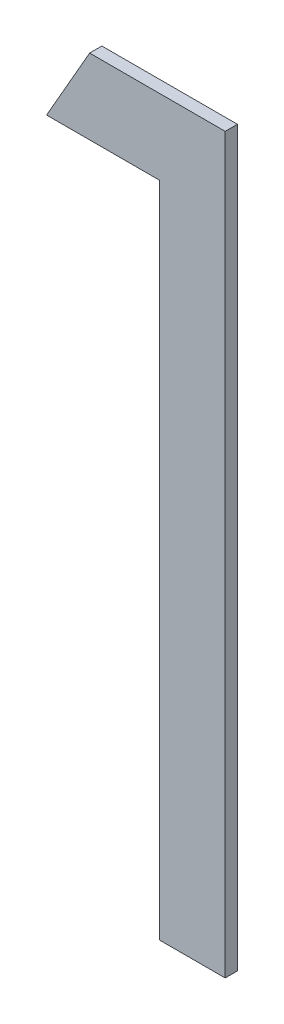
ISO-10303-21;
HEADER;
FILE_DESCRIPTION(('STEP AP214'),'2;1');
FILE_NAME('part.step','',(''),(''),'','','');
FILE_SCHEMA(('AUTOMOTIVE_DESIGN { 1 0 10303 214 1 1 1 1 }'));
ENDSEC;
DATA;
#1=APPLICATION_CONTEXT('core data for automotive mechanical design processes');
#2=APPLICATION_PROTOCOL_DEFINITION('international standard','automotive_design',2000,#1);
#3=PRODUCT_CONTEXT('',#1,'mechanical');
#4=PRODUCT('Part','Part','',(#3));
#5=PRODUCT_RELATED_PRODUCT_CATEGORY('part','',(#4));
#6=PRODUCT_DEFINITION_FORMATION('','',#4);
#7=PRODUCT_DEFINITION_CONTEXT('part definition',#1,'design');
#8=PRODUCT_DEFINITION('design','',#6,#7);
#9=PRODUCT_DEFINITION_SHAPE('','',#8);
#10=(LENGTH_UNIT() NAMED_UNIT(*) SI_UNIT(.MILLI.,.METRE.));
#11=(NAMED_UNIT(*) PLANE_ANGLE_UNIT() SI_UNIT($,.RADIAN.));
#12=(NAMED_UNIT(*) SI_UNIT($,.STERADIAN.) SOLID_ANGLE_UNIT());
#13=UNCERTAINTY_MEASURE_WITH_UNIT(LENGTH_MEASURE(1.E-05),#10,'distance_accuracy_value','');
#14=(GEOMETRIC_REPRESENTATION_CONTEXT(3) GLOBAL_UNCERTAINTY_ASSIGNED_CONTEXT((#13)) GLOBAL_UNIT_ASSIGNED_CONTEXT((#10,
#11,#12)) REPRESENTATION_CONTEXT('',''));
#15=CARTESIAN_POINT('',(0.,0.,0.));
#16=DIRECTION('',(0.,0.,1.));
#17=DIRECTION('',(1.,0.,0.));
#18=AXIS2_PLACEMENT_3D('',#15,#16,#17);
#19=CARTESIAN_POINT('',(0.426153846153846,0.912730110006543,0.551));
#20=DIRECTION('',(-0.867930013859703,0.496686511837693,0.));
#21=DIRECTION('',(-0.496686511837693,-0.867930013859703,0.));
#22=AXIS2_PLACEMENT_3D('',#19,#20,#21);
#23=PLANE('',#22);
#24=DIRECTION('',(0.496686511837692,0.867930013859704,0.));
#25=VECTOR('',#24,1.);
#26=CARTESIAN_POINT('',(0.426153846153846,0.912730110006543,0.55));
#27=LINE('',#26,#25);
#28=CARTESIAN_POINT('',(0.426153846153846,0.912730110006543,0.55));
#29=VERTEX_POINT('',#28);
#30=CARTESIAN_POINT('',(0.429675480769231,0.918883956160389,0.55));
#31=VERTEX_POINT('',#30);
#32=EDGE_CURVE('E11',#29,#31,#27,.T.);
#33=ORIENTED_EDGE('',*,*,#32,.F.);
#34=DIRECTION('',(0.,0.,-1.));
#35=VECTOR('',#34,1.);
#36=CARTESIAN_POINT('',(0.426153846153846,0.912730110006543,0.551));
#37=LINE('',#36,#35);
#38=CARTESIAN_POINT('',(0.426153846153846,0.912730110006543,0.551));
#39=VERTEX_POINT('',#38);
#40=EDGE_CURVE('E119',#39,#29,#37,.T.);
#41=ORIENTED_EDGE('',*,*,#40,.F.);
#42=DIRECTION('',(0.496686511837692,0.867930013859704,0.));
#43=VECTOR('',#42,1.);
#44=CARTESIAN_POINT('',(0.426153846153846,0.912730110006543,0.551));
#45=LINE('',#44,#43);
#46=CARTESIAN_POINT('',(0.429675480769231,0.918883956160389,0.551));
#47=VERTEX_POINT('',#46);
#48=EDGE_CURVE('E112',#39,#47,#45,.T.);
#49=ORIENTED_EDGE('',*,*,#48,.T.);
#50=DIRECTION('',(0.,0.,-1.));
#51=VECTOR('',#50,1.);
#52=CARTESIAN_POINT('',(0.429675480769231,0.918883956160389,0.551));
#53=LINE('',#52,#51);
#54=EDGE_CURVE('E85',#47,#31,#53,.T.);
#55=ORIENTED_EDGE('',*,*,#54,.T.);
#56=EDGE_LOOP('',(#33,#41,#49,#55));
#57=FACE_BOUND('',#56,.T.);
#58=ADVANCED_FACE('F17',(#57),#23,.T.);
#59=CARTESIAN_POINT('',(0.435384615384616,0.912730110006543,0.551));
#60=DIRECTION('',(0.,-1.,0.));
#61=DIRECTION('',(0.,0.,-1.));
#62=AXIS2_PLACEMENT_3D('',#59,#60,#61);
#63=PLANE('',#62);
#64=DIRECTION('',(-1.,0.,0.));
#65=VECTOR('',#64,1.);
#66=CARTESIAN_POINT('',(0.435384615384616,0.912730110006543,0.55));
#67=LINE('',#66,#65);
#68=CARTESIAN_POINT('',(0.435384615384616,0.912730110006543,0.55));
#69=VERTEX_POINT('',#68);
#70=EDGE_CURVE('E24',#69,#29,#67,.T.);
#71=ORIENTED_EDGE('',*,*,#70,.F.);
#72=DIRECTION('',(0.,0.,-1.));
#73=VECTOR('',#72,1.);
#74=CARTESIAN_POINT('',(0.435384615384616,0.912730110006543,0.551));
#75=LINE('',#74,#73);
#76=CARTESIAN_POINT('',(0.435384615384616,0.912730110006543,0.551));
#77=VERTEX_POINT('',#76);
#78=EDGE_CURVE('E114',#77,#69,#75,.T.);
#79=ORIENTED_EDGE('',*,*,#78,.F.);
#80=DIRECTION('',(-1.,0.,0.));
#81=VECTOR('',#80,1.);
#82=CARTESIAN_POINT('',(0.435384615384616,0.912730110006543,0.551));
#83=LINE('',#82,#81);
#84=EDGE_CURVE('E103',#77,#39,#83,.T.);
#85=ORIENTED_EDGE('',*,*,#84,.T.);
#86=ORIENTED_EDGE('',*,*,#40,.T.);
#87=EDGE_LOOP('',(#71,#79,#85,#86));
#88=FACE_BOUND('',#87,.T.);
#89=ADVANCED_FACE('F127',(#88),#63,.T.);
#90=CARTESIAN_POINT('',(0.435384615384616,0.858883956160389,0.551));
#91=DIRECTION('',(-1.,0.,0.));
#92=DIRECTION('',(0.,0.,1.));
#93=AXIS2_PLACEMENT_3D('',#90,#91,#92);
#94=PLANE('',#93);
#95=DIRECTION('',(0.,1.,0.));
#96=VECTOR('',#95,1.);
#97=CARTESIAN_POINT('',(0.435384615384616,0.858883956160389,0.55));
#98=LINE('',#97,#96);
#99=CARTESIAN_POINT('',(0.435384615384616,0.858883956160389,0.55));
#100=VERTEX_POINT('',#99);
#101=EDGE_CURVE('E116',#100,#69,#98,.T.);
#102=ORIENTED_EDGE('',*,*,#101,.F.);
#103=DIRECTION('',(0.,0.,-1.));
#104=VECTOR('',#103,1.);
#105=CARTESIAN_POINT('',(0.435384615384616,0.858883956160389,0.551));
#106=LINE('',#105,#104);
#107=CARTESIAN_POINT('',(0.435384615384616,0.858883956160389,0.551));
#108=VERTEX_POINT('',#107);
#109=EDGE_CURVE('E106',#108,#100,#106,.T.);
#110=ORIENTED_EDGE('',*,*,#109,.F.);
#111=DIRECTION('',(0.,1.,0.));
#112=VECTOR('',#111,1.);
#113=CARTESIAN_POINT('',(0.435384615384616,0.858883956160389,0.551));
#114=LINE('',#113,#112);
#115=EDGE_CURVE('E96',#108,#77,#114,.T.);
#116=ORIENTED_EDGE('',*,*,#115,.T.);
#117=ORIENTED_EDGE('',*,*,#78,.T.);
#118=EDGE_LOOP('',(#102,#110,#116,#117));
#119=FACE_BOUND('',#118,.T.);
#120=ADVANCED_FACE('F123',(#119),#94,.T.);
#121=CARTESIAN_POINT('',(0.440769230769231,0.858883956160389,0.551));
#122=DIRECTION('',(0.,-1.,0.));
#123=DIRECTION('',(0.,0.,-1.));
#124=AXIS2_PLACEMENT_3D('',#121,#122,#123);
#125=PLANE('',#124);
#126=DIRECTION('',(-1.,0.,0.));
#127=VECTOR('',#126,1.);
#128=CARTESIAN_POINT('',(0.440769230769231,0.858883956160389,0.55));
#129=LINE('',#128,#127);
#130=CARTESIAN_POINT('',(0.440769230769231,0.858883956160389,0.55));
#131=VERTEX_POINT('',#130);
#132=EDGE_CURVE('E109',#131,#100,#129,.T.);
#133=ORIENTED_EDGE('',*,*,#132,.F.);
#134=DIRECTION('',(0.,0.,-1.));
#135=VECTOR('',#134,1.);
#136=CARTESIAN_POINT('',(0.440769230769231,0.858883956160389,0.551));
#137=LINE('',#136,#135);
#138=CARTESIAN_POINT('',(0.440769230769231,0.858883956160389,0.551));
#139=VERTEX_POINT('',#138);
#140=EDGE_CURVE('E99',#139,#131,#137,.T.);
#141=ORIENTED_EDGE('',*,*,#140,.F.);
#142=DIRECTION('',(-1.,0.,0.));
#143=VECTOR('',#142,1.);
#144=CARTESIAN_POINT('',(0.440769230769231,0.858883956160389,0.551));
#145=LINE('',#144,#143);
#146=EDGE_CURVE('E79',#139,#108,#145,.T.);
#147=ORIENTED_EDGE('',*,*,#146,.T.);
#148=ORIENTED_EDGE('',*,*,#109,.T.);
#149=EDGE_LOOP('',(#133,#141,#147,#148));
#150=FACE_BOUND('',#149,.T.);
#151=ADVANCED_FACE('F125',(#150),#125,.T.);
#152=CARTESIAN_POINT('',(0.440769230769231,0.918883956160389,0.551));
#153=DIRECTION('',(1.,0.,0.));
#154=DIRECTION('',(0.,0.,-1.));
#155=AXIS2_PLACEMENT_3D('',#152,#153,#154);
#156=PLANE('',#155);
#157=DIRECTION('',(0.,-1.,0.));
#158=VECTOR('',#157,1.);
#159=CARTESIAN_POINT('',(0.440769230769231,0.918883956160389,0.55));
#160=LINE('',#159,#158);
#161=CARTESIAN_POINT('',(0.440769230769231,0.918883956160389,0.55));
#162=VERTEX_POINT('',#161);
#163=EDGE_CURVE('E74',#162,#131,#160,.T.);
#164=ORIENTED_EDGE('',*,*,#163,.F.);
#165=DIRECTION('',(0.,0.,-1.));
#166=VECTOR('',#165,1.);
#167=CARTESIAN_POINT('',(0.440769230769231,0.918883956160389,0.551));
#168=LINE('',#167,#166);
#169=CARTESIAN_POINT('',(0.440769230769231,0.918883956160389,0.551));
#170=VERTEX_POINT('',#169);
#171=EDGE_CURVE('E66',#170,#162,#168,.T.);
#172=ORIENTED_EDGE('',*,*,#171,.F.);
#173=DIRECTION('',(0.,-1.,0.));
#174=VECTOR('',#173,1.);
#175=CARTESIAN_POINT('',(0.440769230769231,0.918883956160389,0.551));
#176=LINE('',#175,#174);
#177=EDGE_CURVE('E71',#170,#139,#176,.T.);
#178=ORIENTED_EDGE('',*,*,#177,.T.);
#179=ORIENTED_EDGE('',*,*,#140,.T.);
#180=EDGE_LOOP('',(#164,#172,#178,#179));
#181=FACE_BOUND('',#180,.T.);
#182=ADVANCED_FACE('F68',(#181),#156,.T.);
#183=CARTESIAN_POINT('',(0.429675480769231,0.918883956160389,0.551));
#184=DIRECTION('',(0.,1.,0.));
#185=DIRECTION('',(0.,0.,1.));
#186=AXIS2_PLACEMENT_3D('',#183,#184,#185);
#187=PLANE('',#186);
#188=DIRECTION('',(1.,0.,0.));
#189=VECTOR('',#188,1.);
#190=CARTESIAN_POINT('',(0.429675480769231,0.918883956160389,0.55));
#191=LINE('',#190,#189);
#192=EDGE_CURVE('E78',#31,#162,#191,.T.);
#193=ORIENTED_EDGE('',*,*,#192,.F.);
#194=ORIENTED_EDGE('',*,*,#54,.F.);
#195=DIRECTION('',(1.,0.,0.));
#196=VECTOR('',#195,1.);
#197=CARTESIAN_POINT('',(0.429675480769231,0.918883956160389,0.551));
#198=LINE('',#197,#196);
#199=EDGE_CURVE('E83',#47,#170,#198,.T.);
#200=ORIENTED_EDGE('',*,*,#199,.T.);
#201=ORIENTED_EDGE('',*,*,#171,.T.);
#202=EDGE_LOOP('',(#193,#194,#200,#201));
#203=FACE_BOUND('',#202,.T.);
#204=ADVANCED_FACE('F84',(#203),#187,.T.);
#205=CARTESIAN_POINT('',(0.,0.,0.551));
#206=DIRECTION('',(0.,0.,-1.));
#207=DIRECTION('',(-1.,0.,0.));
#208=AXIS2_PLACEMENT_3D('',#205,#206,#207);
#209=PLANE('',#208);
#210=ORIENTED_EDGE('',*,*,#48,.F.);
#211=ORIENTED_EDGE('',*,*,#84,.F.);
#212=ORIENTED_EDGE('',*,*,#115,.F.);
#213=ORIENTED_EDGE('',*,*,#146,.F.);
#214=ORIENTED_EDGE('',*,*,#177,.F.);
#215=ORIENTED_EDGE('',*,*,#199,.F.);
#216=EDGE_LOOP('',(#210,#211,#212,#213,#214,#215));
#217=FACE_BOUND('',#216,.T.);
#218=ADVANCED_FACE('F89',(#217),#209,.F.);
#219=CARTESIAN_POINT('',(0.,0.,0.55));
#220=DIRECTION('',(0.,0.,-1.));
#221=DIRECTION('',(-1.,0.,0.));
#222=AXIS2_PLACEMENT_3D('',#219,#220,#221);
#223=PLANE('',#222);
#224=ORIENTED_EDGE('',*,*,#32,.T.);
#225=ORIENTED_EDGE('',*,*,#192,.T.);
#226=ORIENTED_EDGE('',*,*,#163,.T.);
#227=ORIENTED_EDGE('',*,*,#132,.T.);
#228=ORIENTED_EDGE('',*,*,#101,.T.);
#229=ORIENTED_EDGE('',*,*,#70,.T.);
#230=EDGE_LOOP('',(#224,#225,#226,#227,#228,#229));
#231=FACE_BOUND('',#230,.T.);
#232=ADVANCED_FACE('F121',(#231),#223,.T.);
#233=CLOSED_SHELL('',(#58,#89,#120,#151,#182,#204,#218,#232));
#234=MANIFOLD_SOLID_BREP('B1',#233);
#235=ADVANCED_BREP_SHAPE_REPRESENTATION('',(#18,#234),#14);
#236=SHAPE_DEFINITION_REPRESENTATION(#9,#235);
ENDSEC;
END-ISO-10303-21;
